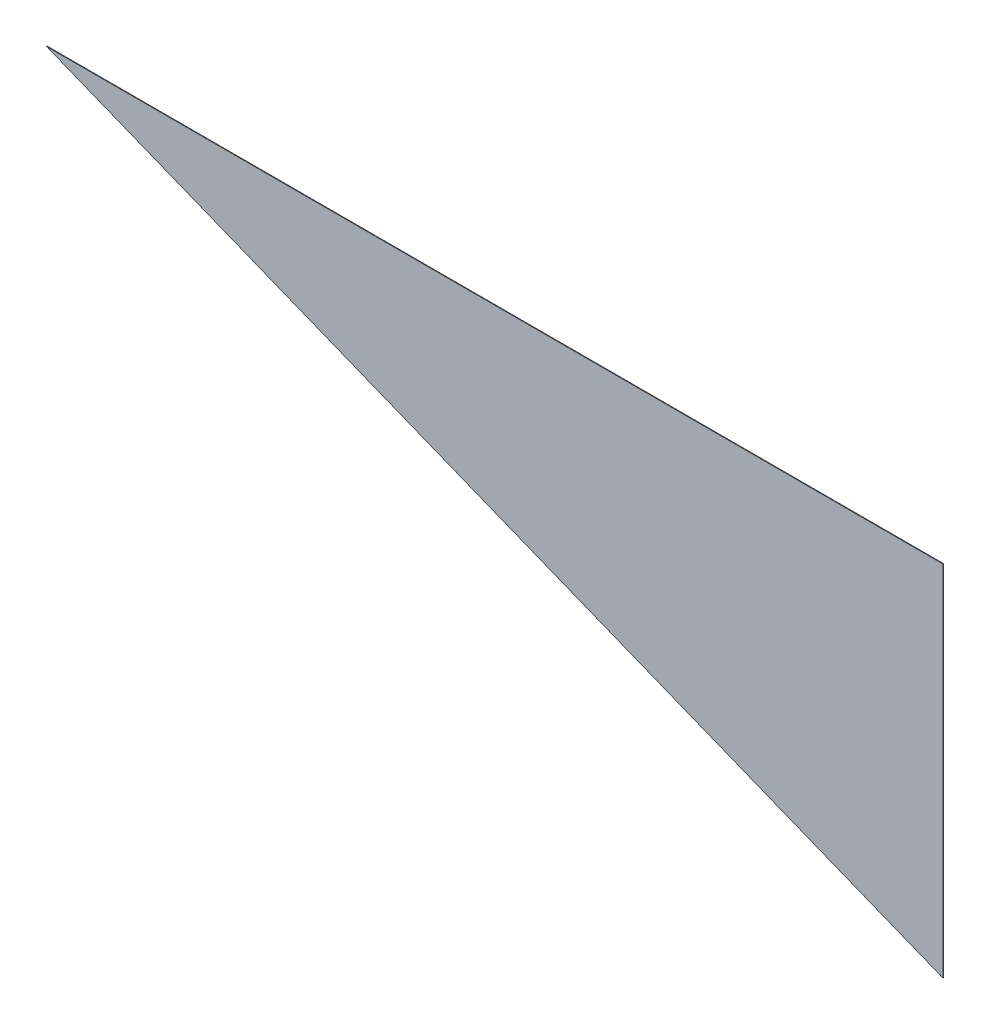
ISO-10303-21;
HEADER;
FILE_DESCRIPTION(('STEP AP214'),'2;1');
FILE_NAME('part.step','',(''),(''),'','','');
FILE_SCHEMA(('AUTOMOTIVE_DESIGN { 1 0 10303 214 1 1 1 1 }'));
ENDSEC;
DATA;
#1=APPLICATION_CONTEXT('core data for automotive mechanical design processes');
#2=APPLICATION_PROTOCOL_DEFINITION('international standard','automotive_design',2000,#1);
#3=PRODUCT_CONTEXT('',#1,'mechanical');
#4=PRODUCT('Part','Part','',(#3));
#5=PRODUCT_RELATED_PRODUCT_CATEGORY('part','',(#4));
#6=PRODUCT_DEFINITION_FORMATION('','',#4);
#7=PRODUCT_DEFINITION_CONTEXT('part definition',#1,'design');
#8=PRODUCT_DEFINITION('design','',#6,#7);
#9=PRODUCT_DEFINITION_SHAPE('','',#8);
#10=(LENGTH_UNIT() NAMED_UNIT(*) SI_UNIT(.MILLI.,.METRE.));
#11=(NAMED_UNIT(*) PLANE_ANGLE_UNIT() SI_UNIT($,.RADIAN.));
#12=(NAMED_UNIT(*) SI_UNIT($,.STERADIAN.) SOLID_ANGLE_UNIT());
#13=UNCERTAINTY_MEASURE_WITH_UNIT(LENGTH_MEASURE(1.E-05),#10,'distance_accuracy_value','');
#14=(GEOMETRIC_REPRESENTATION_CONTEXT(3) GLOBAL_UNCERTAINTY_ASSIGNED_CONTEXT((#13)) GLOBAL_UNIT_ASSIGNED_CONTEXT((#10,
#11,#12)) REPRESENTATION_CONTEXT('',''));
#15=CARTESIAN_POINT('',(0.,0.,0.));
#16=DIRECTION('',(0.,0.,1.));
#17=DIRECTION('',(1.,0.,0.));
#18=AXIS2_PLACEMENT_3D('',#15,#16,#17);
#19=CARTESIAN_POINT('',(0.125,-0.05,0.01));
#20=DIRECTION('',(-0.371390676354104,-0.928476690885259,0.));
#21=DIRECTION('',(-0.928476690885259,0.371390676354104,0.));
#22=AXIS2_PLACEMENT_3D('',#19,#20,#21);
#23=PLANE('',#22);
#24=DIRECTION('',(-0.928476690885259,0.371390676354104,0.));
#25=VECTOR('',#24,1.);
#26=CARTESIAN_POINT('',(0.125,-0.05,0.));
#27=LINE('',#26,#25);
#28=CARTESIAN_POINT('',(0.125,-0.05,0.));
#29=VERTEX_POINT('',#28);
#30=CARTESIAN_POINT('',(-0.125,0.05,0.));
#31=VERTEX_POINT('',#30);
#32=EDGE_CURVE('E81',#29,#31,#27,.T.);
#33=ORIENTED_EDGE('',*,*,#32,.F.);
#34=DIRECTION('',(0.,0.,-1.));
#35=VECTOR('',#34,1.);
#36=CARTESIAN_POINT('',(0.125,-0.05,0.01));
#37=LINE('',#36,#35);
#38=CARTESIAN_POINT('',(0.125,-0.05,0.0001771235930937));
#39=VERTEX_POINT('',#38);
#40=EDGE_CURVE('E11',#39,#29,#37,.T.);
#41=ORIENTED_EDGE('',*,*,#40,.F.);
#42=DIRECTION('',(-0.928476690885259,0.371390676354104,0.));
#43=VECTOR('',#42,1.);
#44=CARTESIAN_POINT('',(0.125,-0.05,0.0001771235930937));
#45=LINE('',#44,#43);
#46=CARTESIAN_POINT('',(-0.125,0.05,0.0001771235930937));
#47=VERTEX_POINT('',#46);
#48=EDGE_CURVE('E66',#39,#47,#45,.T.);
#49=ORIENTED_EDGE('',*,*,#48,.T.);
#50=DIRECTION('',(0.,0.,-1.));
#51=VECTOR('',#50,1.);
#52=CARTESIAN_POINT('',(-0.125,0.05,0.01));
#53=LINE('',#52,#51);
#54=EDGE_CURVE('E39',#47,#31,#53,.T.);
#55=ORIENTED_EDGE('',*,*,#54,.T.);
#56=EDGE_LOOP('',(#33,#41,#49,#55));
#57=FACE_BOUND('',#56,.T.);
#58=ADVANCED_FACE('F16',(#57),#23,.T.);
#59=CARTESIAN_POINT('',(0.125,0.05,0.01));
#60=DIRECTION('',(1.,0.,0.));
#61=DIRECTION('',(0.,1.,0.));
#62=AXIS2_PLACEMENT_3D('',#59,#60,#61);
#63=PLANE('',#62);
#64=DIRECTION('',(0.,-1.,0.));
#65=VECTOR('',#64,1.);
#66=CARTESIAN_POINT('',(0.125,0.05,0.));
#67=LINE('',#66,#65);
#68=CARTESIAN_POINT('',(0.125,0.05,0.));
#69=VERTEX_POINT('',#68);
#70=EDGE_CURVE('E70',#69,#29,#67,.T.);
#71=ORIENTED_EDGE('',*,*,#70,.F.);
#72=DIRECTION('',(0.,0.,-1.));
#73=VECTOR('',#72,1.);
#74=CARTESIAN_POINT('',(0.125,0.05,0.01));
#75=LINE('',#74,#73);
#76=CARTESIAN_POINT('',(0.125,0.05,0.0001771235930937));
#77=VERTEX_POINT('',#76);
#78=EDGE_CURVE('E26',#77,#69,#75,.T.);
#79=ORIENTED_EDGE('',*,*,#78,.F.);
#80=DIRECTION('',(0.,-1.,0.));
#81=VECTOR('',#80,1.);
#82=CARTESIAN_POINT('',(0.125,0.05,0.0001771235930937));
#83=LINE('',#82,#81);
#84=EDGE_CURVE('E73',#77,#39,#83,.T.);
#85=ORIENTED_EDGE('',*,*,#84,.T.);
#86=ORIENTED_EDGE('',*,*,#40,.T.);
#87=EDGE_LOOP('',(#71,#79,#85,#86));
#88=FACE_BOUND('',#87,.T.);
#89=ADVANCED_FACE('F93',(#88),#63,.T.);
#90=CARTESIAN_POINT('',(-0.125,0.05,0.01));
#91=DIRECTION('',(0.,1.,0.));
#92=DIRECTION('',(1.,0.,0.));
#93=AXIS2_PLACEMENT_3D('',#90,#91,#92);
#94=PLANE('',#93);
#95=DIRECTION('',(1.,0.,0.));
#96=VECTOR('',#95,1.);
#97=CARTESIAN_POINT('',(-0.125,0.05,0.));
#98=LINE('',#97,#96);
#99=EDGE_CURVE('E19',#31,#69,#98,.T.);
#100=ORIENTED_EDGE('',*,*,#99,.F.);
#101=ORIENTED_EDGE('',*,*,#54,.F.);
#102=DIRECTION('',(1.,0.,0.));
#103=VECTOR('',#102,1.);
#104=CARTESIAN_POINT('',(-0.125,0.05,0.0001771235930937));
#105=LINE('',#104,#103);
#106=EDGE_CURVE('E59',#47,#77,#105,.T.);
#107=ORIENTED_EDGE('',*,*,#106,.T.);
#108=ORIENTED_EDGE('',*,*,#78,.T.);
#109=EDGE_LOOP('',(#100,#101,#107,#108));
#110=FACE_BOUND('',#109,.T.);
#111=ADVANCED_FACE('F57',(#110),#94,.T.);
#112=CARTESIAN_POINT('',(0.,0.,0.));
#113=DIRECTION('',(0.,0.,1.));
#114=DIRECTION('',(1.,0.,0.));
#115=AXIS2_PLACEMENT_3D('',#112,#113,#114);
#116=PLANE('',#115);
#117=ORIENTED_EDGE('',*,*,#70,.T.);
#118=ORIENTED_EDGE('',*,*,#32,.T.);
#119=ORIENTED_EDGE('',*,*,#99,.T.);
#120=EDGE_LOOP('',(#117,#118,#119));
#121=FACE_BOUND('',#120,.T.);
#122=ADVANCED_FACE('F92',(#121),#116,.F.);
#123=CARTESIAN_POINT('',(0.,0.,0.0001771235930937));
#124=DIRECTION('',(0.,0.,1.));
#125=DIRECTION('',(1.,0.,0.));
#126=AXIS2_PLACEMENT_3D('',#123,#124,#125);
#127=PLANE('',#126);
#128=ORIENTED_EDGE('',*,*,#84,.F.);
#129=ORIENTED_EDGE('',*,*,#106,.F.);
#130=ORIENTED_EDGE('',*,*,#48,.F.);
#131=EDGE_LOOP('',(#128,#129,#130));
#132=FACE_BOUND('',#131,.T.);
#133=ADVANCED_FACE('F72',(#132),#127,.T.);
#134=CLOSED_SHELL('',(#58,#89,#111,#122,#133));
#135=MANIFOLD_SOLID_BREP('B1',#134);
#136=ADVANCED_BREP_SHAPE_REPRESENTATION('',(#18,#135),#14);
#137=SHAPE_DEFINITION_REPRESENTATION(#9,#136);
ENDSEC;
END-ISO-10303-21;
